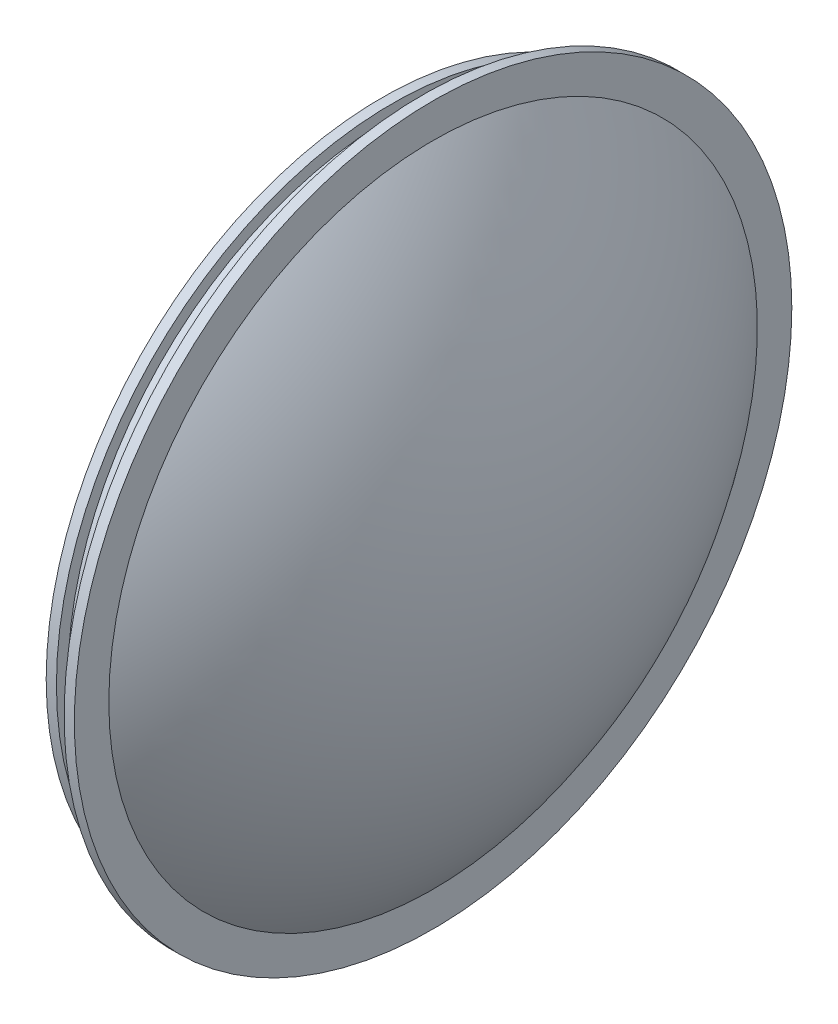
ISO-10303-21;
HEADER;
FILE_DESCRIPTION(('STEP AP214'),'2;1');
FILE_NAME('part.step','',(''),(''),'','','');
FILE_SCHEMA(('AUTOMOTIVE_DESIGN { 1 0 10303 214 1 1 1 1 }'));
ENDSEC;
DATA;
#1=APPLICATION_CONTEXT('core data for automotive mechanical design processes');
#2=APPLICATION_PROTOCOL_DEFINITION('international standard','automotive_design',2000,#1);
#3=PRODUCT_CONTEXT('',#1,'mechanical');
#4=PRODUCT('Part','Part','',(#3));
#5=PRODUCT_RELATED_PRODUCT_CATEGORY('part','',(#4));
#6=PRODUCT_DEFINITION_FORMATION('','',#4);
#7=PRODUCT_DEFINITION_CONTEXT('part definition',#1,'design');
#8=PRODUCT_DEFINITION('design','',#6,#7);
#9=PRODUCT_DEFINITION_SHAPE('','',#8);
#10=(LENGTH_UNIT() NAMED_UNIT(*) SI_UNIT(.MILLI.,.METRE.));
#11=(NAMED_UNIT(*) PLANE_ANGLE_UNIT() SI_UNIT($,.RADIAN.));
#12=(NAMED_UNIT(*) SI_UNIT($,.STERADIAN.) SOLID_ANGLE_UNIT());
#13=UNCERTAINTY_MEASURE_WITH_UNIT(LENGTH_MEASURE(1.E-05),#10,'distance_accuracy_value','');
#14=(GEOMETRIC_REPRESENTATION_CONTEXT(3) GLOBAL_UNCERTAINTY_ASSIGNED_CONTEXT((#13)) GLOBAL_UNIT_ASSIGNED_CONTEXT((#10,
#11,#12)) REPRESENTATION_CONTEXT('',''));
#15=CARTESIAN_POINT('',(0.,0.,0.));
#16=DIRECTION('',(0.,0.,1.));
#17=DIRECTION('',(1.,0.,0.));
#18=AXIS2_PLACEMENT_3D('',#15,#16,#17);
#19=CARTESIAN_POINT('',(350.,0.,0.));
#20=DIRECTION('',(1.,0.,0.));
#21=DIRECTION('',(0.,0.,-1.));
#22=AXIS2_PLACEMENT_3D('',#19,#20,#21);
#23=CYLINDRICAL_SURFACE('',#22,316.385840391127);
#24=CARTESIAN_POINT('',(390.,0.,0.));
#25=DIRECTION('',(1.,0.,0.));
#26=DIRECTION('',(0.,0.,-1.));
#27=AXIS2_PLACEMENT_3D('',#24,#25,#26);
#28=CIRCLE('',#27,316.385840391127);
#29=CARTESIAN_POINT('',(390.,0.,-316.385840391127));
#30=VERTEX_POINT('',#29);
#31=EDGE_CURVE('E67',#30,#30,#28,.T.);
#32=ORIENTED_EDGE('',*,*,#31,.F.);
#33=EDGE_LOOP('',(#32));
#34=FACE_BOUND('',#33,.T.);
#35=CARTESIAN_POINT('',(360.,0.,0.));
#36=DIRECTION('',(-1.,0.,0.));
#37=DIRECTION('',(0.,0.,1.));
#38=AXIS2_PLACEMENT_3D('',#35,#36,#37);
#39=CIRCLE('',#38,316.385840391127);
#40=CARTESIAN_POINT('',(360.,0.,316.385840391127));
#41=VERTEX_POINT('',#40);
#42=EDGE_CURVE('E10',#41,#41,#39,.T.);
#43=ORIENTED_EDGE('',*,*,#42,.F.);
#44=EDGE_LOOP('',(#43));
#45=FACE_BOUND('',#44,.T.);
#46=ADVANCED_FACE('F39',(#34,#45),#23,.T.);
#47=CARTESIAN_POINT('',(390.,0.,0.));
#48=DIRECTION('',(1.,0.,0.));
#49=DIRECTION('',(0.,0.,-1.));
#50=AXIS2_PLACEMENT_3D('',#47,#48,#49);
#51=CYLINDRICAL_SURFACE('',#50,350.);
#52=CARTESIAN_POINT('',(390.,0.,0.));
#53=DIRECTION('',(1.,0.,0.));
#54=DIRECTION('',(0.,0.,-1.));
#55=AXIS2_PLACEMENT_3D('',#52,#53,#54);
#56=CIRCLE('',#55,350.);
#57=CARTESIAN_POINT('',(390.,0.,-350.));
#58=VERTEX_POINT('',#57);
#59=EDGE_CURVE('E75',#58,#58,#56,.T.);
#60=ORIENTED_EDGE('',*,*,#59,.T.);
#61=EDGE_LOOP('',(#60));
#62=FACE_BOUND('',#61,.T.);
#63=CARTESIAN_POINT('',(400.,0.,0.));
#64=DIRECTION('',(1.,0.,0.));
#65=DIRECTION('',(0.,0.,-1.));
#66=AXIS2_PLACEMENT_3D('',#63,#64,#65);
#67=CIRCLE('',#66,350.);
#68=CARTESIAN_POINT('',(400.,0.,-350.));
#69=VERTEX_POINT('',#68);
#70=EDGE_CURVE('E76',#69,#69,#67,.T.);
#71=ORIENTED_EDGE('',*,*,#70,.F.);
#72=EDGE_LOOP('',(#71));
#73=FACE_BOUND('',#72,.T.);
#74=ADVANCED_FACE('F108',(#62,#73),#51,.T.);
#75=CARTESIAN_POINT('',(390.,0.,0.));
#76=DIRECTION('',(1.,0.,0.));
#77=DIRECTION('',(0.,0.,-1.));
#78=AXIS2_PLACEMENT_3D('',#75,#76,#77);
#79=PLANE('',#78);
#80=ORIENTED_EDGE('',*,*,#31,.T.);
#81=EDGE_LOOP('',(#80));
#82=FACE_BOUND('',#81,.T.);
#83=ORIENTED_EDGE('',*,*,#59,.F.);
#84=EDGE_LOOP('',(#83));
#85=FACE_BOUND('',#84,.T.);
#86=ADVANCED_FACE('F116',(#82,#85),#79,.F.);
#87=CARTESIAN_POINT('',(400.,0.,0.));
#88=DIRECTION('',(1.,0.,0.));
#89=DIRECTION('',(0.,0.,-1.));
#90=AXIS2_PLACEMENT_3D('',#87,#88,#89);
#91=PLANE('',#90);
#92=CARTESIAN_POINT('',(400.,0.,0.));
#93=DIRECTION('',(-1.,0.,0.));
#94=DIRECTION('',(0.,0.,1.));
#95=AXIS2_PLACEMENT_3D('',#92,#93,#94);
#96=CIRCLE('',#95,316.385840391127);
#97=CARTESIAN_POINT('',(400.,0.,316.385840391127));
#98=VERTEX_POINT('',#97);
#99=EDGE_CURVE('E71',#98,#98,#96,.T.);
#100=ORIENTED_EDGE('',*,*,#99,.T.);
#101=EDGE_LOOP('',(#100));
#102=FACE_BOUND('',#101,.T.);
#103=ORIENTED_EDGE('',*,*,#70,.T.);
#104=EDGE_LOOP('',(#103));
#105=FACE_BOUND('',#104,.T.);
#106=ADVANCED_FACE('F126',(#102,#105),#91,.T.);
#107=CARTESIAN_POINT('',(0.,0.,0.));
#108=DIRECTION('',(0.,1.,0.));
#109=DIRECTION('',(1.,0.,0.));
#110=AXIS2_PLACEMENT_3D('',#107,#108,#109);
#111=SPHERICAL_SURFACE('',#110,510.);
#112=CARTESIAN_POINT('',(0.,0.,0.));
#113=DIRECTION('',(-1.,0.,0.));
#114=DIRECTION('',(0.,0.,1.));
#115=AXIS2_PLACEMENT_3D('',#112,#113,#114);
#116=SPHERICAL_SURFACE('',#115,510.);
#117=ORIENTED_EDGE('',*,*,#99,.F.);
#118=EDGE_LOOP('',(#117));
#119=FACE_BOUND('',#118,.T.);
#120=ADVANCED_FACE('F105',(#119),#116,.T.);
#121=CARTESIAN_POINT('',(360.,0.,0.));
#122=DIRECTION('',(-1.,0.,0.));
#123=DIRECTION('',(0.,0.,1.));
#124=AXIS2_PLACEMENT_3D('',#121,#122,#123);
#125=CYLINDRICAL_SURFACE('',#124,327.5);
#126=CARTESIAN_POINT('',(360.,0.,0.));
#127=DIRECTION('',(-1.,0.,0.));
#128=DIRECTION('',(0.,0.,1.));
#129=AXIS2_PLACEMENT_3D('',#126,#127,#128);
#130=CIRCLE('',#129,327.5);
#131=CARTESIAN_POINT('',(360.,0.,327.5));
#132=VERTEX_POINT('',#131);
#133=EDGE_CURVE('E80',#132,#132,#130,.T.);
#134=ORIENTED_EDGE('',*,*,#133,.T.);
#135=EDGE_LOOP('',(#134));
#136=FACE_BOUND('',#135,.T.);
#137=CARTESIAN_POINT('',(350.,0.,0.));
#138=DIRECTION('',(-1.,0.,0.));
#139=DIRECTION('',(0.,0.,1.));
#140=AXIS2_PLACEMENT_3D('',#137,#138,#139);
#141=CIRCLE('',#140,327.5);
#142=CARTESIAN_POINT('',(350.,0.,327.5));
#143=VERTEX_POINT('',#142);
#144=EDGE_CURVE('E84',#143,#143,#141,.T.);
#145=ORIENTED_EDGE('',*,*,#144,.F.);
#146=EDGE_LOOP('',(#145));
#147=FACE_BOUND('',#146,.T.);
#148=ADVANCED_FACE('F92',(#136,#147),#125,.T.);
#149=CARTESIAN_POINT('',(360.,0.,0.));
#150=DIRECTION('',(-1.,0.,0.));
#151=DIRECTION('',(0.,0.,1.));
#152=AXIS2_PLACEMENT_3D('',#149,#150,#151);
#153=PLANE('',#152);
#154=ORIENTED_EDGE('',*,*,#42,.T.);
#155=EDGE_LOOP('',(#154));
#156=FACE_BOUND('',#155,.T.);
#157=ORIENTED_EDGE('',*,*,#133,.F.);
#158=EDGE_LOOP('',(#157));
#159=FACE_BOUND('',#158,.T.);
#160=ADVANCED_FACE('F95',(#156,#159),#153,.F.);
#161=CARTESIAN_POINT('',(0.,0.,0.));
#162=DIRECTION('',(0.,1.,0.));
#163=DIRECTION('',(1.,0.,0.));
#164=AXIS2_PLACEMENT_3D('',#161,#162,#163);
#165=SPHERICAL_SURFACE('',#164,500.);
#166=CARTESIAN_POINT('',(0.,0.,0.));
#167=DIRECTION('',(-1.,0.,0.));
#168=DIRECTION('',(0.,0.,1.));
#169=AXIS2_PLACEMENT_3D('',#166,#167,#168);
#170=SPHERICAL_SURFACE('',#169,500.);
#171=CARTESIAN_POINT('',(403.028931798602,0.,0.));
#172=DIRECTION('',(-1.,0.,0.));
#173=DIRECTION('',(0.,0.,1.));
#174=AXIS2_PLACEMENT_3D('',#171,#172,#173);
#175=CIRCLE('',#174,295.918367346939);
#176=CARTESIAN_POINT('',(403.028931798602,0.,295.918367346939));
#177=VERTEX_POINT('',#176);
#178=EDGE_CURVE('E47',#177,#177,#175,.T.);
#179=ORIENTED_EDGE('',*,*,#178,.T.);
#180=EDGE_LOOP('',(#179));
#181=FACE_BOUND('',#180,.T.);
#182=ADVANCED_FACE('F97',(#181),#170,.F.);
#183=CARTESIAN_POINT('',(394.96835316263,0.,0.));
#184=DIRECTION('',(-1.,0.,0.));
#185=DIRECTION('',(0.,0.,1.));
#186=AXIS2_PLACEMENT_3D('',#183,#184,#185);
#187=TOROIDAL_SURFACE('',#186,290.,10.);
#188=ORIENTED_EDGE('',*,*,#178,.F.);
#189=EDGE_LOOP('',(#188));
#190=FACE_BOUND('',#189,.T.);
#191=CARTESIAN_POINT('',(394.96835316263,0.,0.));
#192=DIRECTION('',(-1.,0.,0.));
#193=DIRECTION('',(0.,0.,1.));
#194=AXIS2_PLACEMENT_3D('',#191,#192,#193);
#195=CIRCLE('',#194,300.);
#196=CARTESIAN_POINT('',(394.96835316263,0.,300.));
#197=VERTEX_POINT('',#196);
#198=EDGE_CURVE('E63',#197,#197,#195,.F.);
#199=ORIENTED_EDGE('',*,*,#198,.F.);
#200=EDGE_LOOP('',(#199));
#201=FACE_BOUND('',#200,.T.);
#202=ADVANCED_FACE('F41',(#190,#201),#187,.F.);
#203=CARTESIAN_POINT('',(350.,0.,0.));
#204=DIRECTION('',(1.,0.,0.));
#205=DIRECTION('',(0.,0.,-1.));
#206=AXIS2_PLACEMENT_3D('',#203,#204,#205);
#207=CYLINDRICAL_SURFACE('',#206,300.);
#208=CARTESIAN_POINT('',(360.,0.,0.));
#209=DIRECTION('',(-1.,0.,0.));
#210=DIRECTION('',(0.,0.,1.));
#211=AXIS2_PLACEMENT_3D('',#208,#209,#210);
#212=CIRCLE('',#211,300.);
#213=CARTESIAN_POINT('',(360.,0.,300.));
#214=VERTEX_POINT('',#213);
#215=EDGE_CURVE('E57',#214,#214,#212,.T.);
#216=ORIENTED_EDGE('',*,*,#215,.T.);
#217=EDGE_LOOP('',(#216));
#218=FACE_BOUND('',#217,.T.);
#219=ORIENTED_EDGE('',*,*,#198,.T.);
#220=EDGE_LOOP('',(#219));
#221=FACE_BOUND('',#220,.T.);
#222=ADVANCED_FACE('F130',(#218,#221),#207,.F.);
#223=CARTESIAN_POINT('',(360.,0.,0.));
#224=DIRECTION('',(-1.,0.,0.));
#225=DIRECTION('',(0.,0.,1.));
#226=AXIS2_PLACEMENT_3D('',#223,#224,#225);
#227=TOROIDAL_SURFACE('',#226,310.,10.);
#228=CARTESIAN_POINT('',(350.,0.,0.));
#229=DIRECTION('',(-1.,0.,0.));
#230=DIRECTION('',(0.,0.,1.));
#231=AXIS2_PLACEMENT_3D('',#228,#229,#230);
#232=CIRCLE('',#231,310.);
#233=CARTESIAN_POINT('',(350.,0.,310.));
#234=VERTEX_POINT('',#233);
#235=EDGE_CURVE('E52',#234,#234,#232,.F.);
#236=ORIENTED_EDGE('',*,*,#235,.F.);
#237=EDGE_LOOP('',(#236));
#238=FACE_BOUND('',#237,.T.);
#239=ORIENTED_EDGE('',*,*,#215,.F.);
#240=EDGE_LOOP('',(#239));
#241=FACE_BOUND('',#240,.T.);
#242=ADVANCED_FACE('F128',(#238,#241),#227,.T.);
#243=CARTESIAN_POINT('',(350.,0.,0.));
#244=DIRECTION('',(-1.,0.,0.));
#245=DIRECTION('',(0.,0.,1.));
#246=AXIS2_PLACEMENT_3D('',#243,#244,#245);
#247=PLANE('',#246);
#248=ORIENTED_EDGE('',*,*,#235,.T.);
#249=EDGE_LOOP('',(#248));
#250=FACE_BOUND('',#249,.T.);
#251=ORIENTED_EDGE('',*,*,#144,.T.);
#252=EDGE_LOOP('',(#251));
#253=FACE_BOUND('',#252,.T.);
#254=ADVANCED_FACE('F123',(#250,#253),#247,.T.);
#255=CLOSED_SHELL('',(#46,#74,#86,#106,#120,#148,#160,#182,#202,#222,#242,#254));
#256=MANIFOLD_SOLID_BREP('B2',#255);
#257=ADVANCED_BREP_SHAPE_REPRESENTATION('',(#18,#256),#14);
#258=SHAPE_DEFINITION_REPRESENTATION(#9,#257);
ENDSEC;
END-ISO-10303-21;
